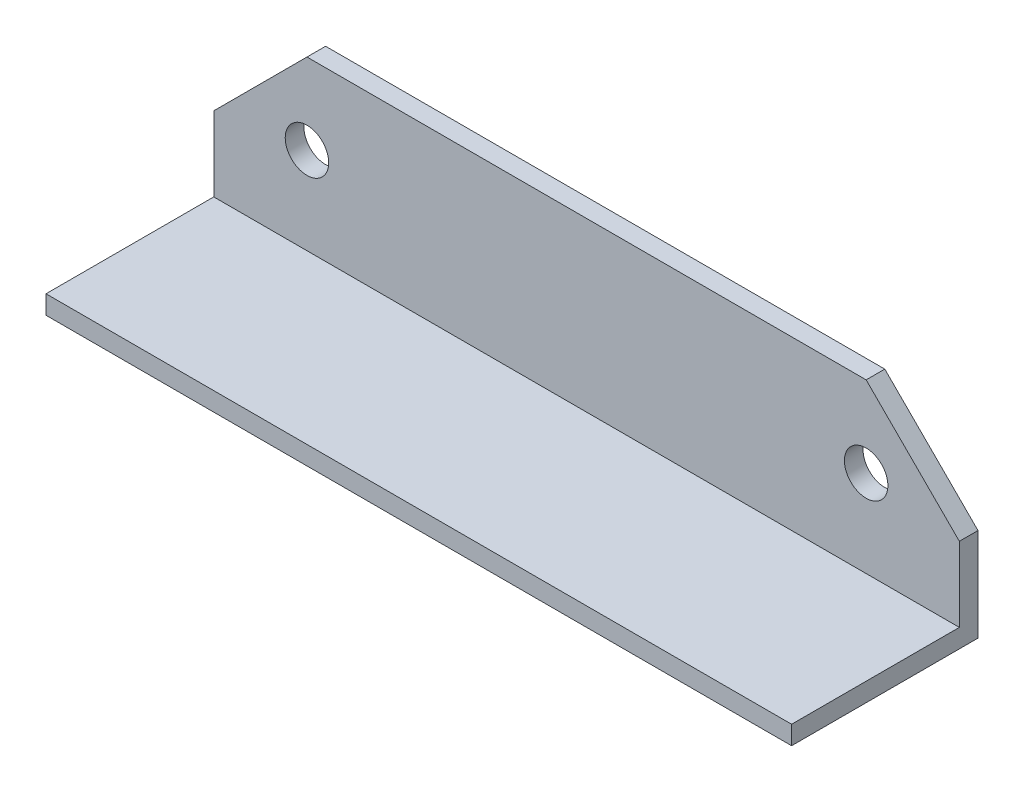
ISO-10303-21;
HEADER;
FILE_DESCRIPTION(('STEP AP214'),'2;1');
FILE_NAME('part.step','',(''),(''),'','','');
FILE_SCHEMA(('AUTOMOTIVE_DESIGN { 1 0 10303 214 1 1 1 1 }'));
ENDSEC;
DATA;
#1=APPLICATION_CONTEXT('core data for automotive mechanical design processes');
#2=APPLICATION_PROTOCOL_DEFINITION('international standard','automotive_design',2000,#1);
#3=PRODUCT_CONTEXT('',#1,'mechanical');
#4=PRODUCT('Part','Part','',(#3));
#5=PRODUCT_RELATED_PRODUCT_CATEGORY('part','',(#4));
#6=PRODUCT_DEFINITION_FORMATION('','',#4);
#7=PRODUCT_DEFINITION_CONTEXT('part definition',#1,'design');
#8=PRODUCT_DEFINITION('design','',#6,#7);
#9=PRODUCT_DEFINITION_SHAPE('','',#8);
#10=(LENGTH_UNIT() NAMED_UNIT(*) SI_UNIT(.MILLI.,.METRE.));
#11=(NAMED_UNIT(*) PLANE_ANGLE_UNIT() SI_UNIT($,.RADIAN.));
#12=(NAMED_UNIT(*) SI_UNIT($,.STERADIAN.) SOLID_ANGLE_UNIT());
#13=UNCERTAINTY_MEASURE_WITH_UNIT(LENGTH_MEASURE(1.E-05),#10,'distance_accuracy_value','');
#14=(GEOMETRIC_REPRESENTATION_CONTEXT(3) GLOBAL_UNCERTAINTY_ASSIGNED_CONTEXT((#13)) GLOBAL_UNIT_ASSIGNED_CONTEXT((#10,
#11,#12)) REPRESENTATION_CONTEXT('',''));
#15=CARTESIAN_POINT('',(0.,0.,0.));
#16=DIRECTION('',(0.,0.,1.));
#17=DIRECTION('',(1.,0.,0.));
#18=AXIS2_PLACEMENT_3D('',#15,#16,#17);
#19=CARTESIAN_POINT('',(0.,0.,-77.1201360343224));
#20=DIRECTION('',(0.,0.,-1.));
#21=DIRECTION('',(-1.,0.,0.));
#22=AXIS2_PLACEMENT_3D('',#19,#20,#21);
#23=PLANE('',#22);
#24=CARTESIAN_POINT('',(-44.999999999999,664.649987792969,-77.1201360343224));
#25=DIRECTION('',(0.,0.,-1.));
#26=DIRECTION('',(-1.,0.,0.));
#27=AXIS2_PLACEMENT_3D('',#24,#25,#26);
#28=CIRCLE('',#27,3.49999999999999);
#29=CARTESIAN_POINT('',(-48.499999999999,664.649987792969,-77.1201360343224));
#30=VERTEX_POINT('',#29);
#31=EDGE_CURVE('E189',#30,#30,#28,.T.);
#32=ORIENTED_EDGE('',*,*,#31,.T.);
#33=EDGE_LOOP('',(#32));
#34=FACE_BOUND('',#33,.T.);
#35=CARTESIAN_POINT('',(45.0000000000004,664.649987792969,-77.1201360343224));
#36=DIRECTION('',(0.,0.,-1.));
#37=DIRECTION('',(-1.,0.,0.));
#38=AXIS2_PLACEMENT_3D('',#35,#36,#37);
#39=CIRCLE('',#38,3.49999999999999);
#40=CARTESIAN_POINT('',(41.5000000000004,664.649987792969,-77.1201360343224));
#41=VERTEX_POINT('',#40);
#42=EDGE_CURVE('E37',#41,#41,#39,.T.);
#43=ORIENTED_EDGE('',*,*,#42,.T.);
#44=EDGE_LOOP('',(#43));
#45=FACE_BOUND('',#44,.T.);
#46=DIRECTION('',(-1.,0.,0.));
#47=VECTOR('',#46,1.);
#48=CARTESIAN_POINT('',(-59.999999999999,650.649987792969,-77.1201360343224));
#49=LINE('',#48,#47);
#50=CARTESIAN_POINT('',(60.0000000000004,650.649987792969,-77.1201360343224));
#51=VERTEX_POINT('',#50);
#52=CARTESIAN_POINT('',(-59.999999999999,650.649987792969,-77.1201360343224));
#53=VERTEX_POINT('',#52);
#54=EDGE_CURVE('E50',#51,#53,#49,.T.);
#55=ORIENTED_EDGE('',*,*,#54,.F.);
#56=DIRECTION('',(0.,1.,0.));
#57=VECTOR('',#56,1.);
#58=CARTESIAN_POINT('',(60.0000000000004,647.649987792969,-77.1201360343224));
#59=LINE('',#58,#57);
#60=CARTESIAN_POINT('',(60.0000000000004,662.649987792969,-77.1201360343224));
#61=VERTEX_POINT('',#60);
#62=EDGE_CURVE('E133',#51,#61,#59,.T.);
#63=ORIENTED_EDGE('',*,*,#62,.T.);
#64=DIRECTION('',(-0.707106781186545,0.70710678118655,0.));
#65=VECTOR('',#64,1.);
#66=CARTESIAN_POINT('',(60.0000000000004,662.649987792969,-77.1201360343224));
#67=LINE('',#66,#65);
#68=CARTESIAN_POINT('',(45.0000000000004,677.649987792969,-77.1201360343224));
#69=VERTEX_POINT('',#68);
#70=EDGE_CURVE('E104',#61,#69,#67,.T.);
#71=ORIENTED_EDGE('',*,*,#70,.T.);
#72=DIRECTION('',(-1.,0.,0.));
#73=VECTOR('',#72,1.);
#74=CARTESIAN_POINT('',(45.0000000000004,677.649987792969,-77.1201360343224));
#75=LINE('',#74,#73);
#76=CARTESIAN_POINT('',(-44.999999999999,677.649987792969,-77.1201360343224));
#77=VERTEX_POINT('',#76);
#78=EDGE_CURVE('E136',#69,#77,#75,.T.);
#79=ORIENTED_EDGE('',*,*,#78,.T.);
#80=DIRECTION('',(-0.707106781186548,-0.707106781186548,0.));
#81=VECTOR('',#80,1.);
#82=CARTESIAN_POINT('',(-44.999999999999,677.649987792969,-77.1201360343224));
#83=LINE('',#82,#81);
#84=CARTESIAN_POINT('',(-59.999999999999,662.649987792969,-77.1201360343224));
#85=VERTEX_POINT('',#84);
#86=EDGE_CURVE('E127',#77,#85,#83,.T.);
#87=ORIENTED_EDGE('',*,*,#86,.T.);
#88=DIRECTION('',(0.,-1.,0.));
#89=VECTOR('',#88,1.);
#90=CARTESIAN_POINT('',(-59.999999999999,662.649987792969,-77.1201360343224));
#91=LINE('',#90,#89);
#92=EDGE_CURVE('E130',#85,#53,#91,.T.);
#93=ORIENTED_EDGE('',*,*,#92,.T.);
#94=EDGE_LOOP('',(#55,#63,#71,#79,#87,#93));
#95=FACE_BOUND('',#94,.T.);
#96=ADVANCED_FACE('F33',(#34,#45,#95),#23,.F.);
#97=CARTESIAN_POINT('',(-44.999999999999,677.649987792969,-80.1201360343224));
#98=DIRECTION('',(-0.707106781186547,0.707106781186547,0.));
#99=DIRECTION('',(-0.707106781186548,-0.707106781186548,0.));
#100=AXIS2_PLACEMENT_3D('',#97,#98,#99);
#101=PLANE('',#100);
#102=ORIENTED_EDGE('',*,*,#86,.F.);
#103=DIRECTION('',(0.,0.,1.));
#104=VECTOR('',#103,1.);
#105=CARTESIAN_POINT('',(-44.999999999999,677.649987792969,-80.1201360343224));
#106=LINE('',#105,#104);
#107=CARTESIAN_POINT('',(-44.999999999999,677.649987792969,-80.1201360343224));
#108=VERTEX_POINT('',#107);
#109=EDGE_CURVE('E11',#108,#77,#106,.T.);
#110=ORIENTED_EDGE('',*,*,#109,.F.);
#111=DIRECTION('',(-0.707106781186548,-0.707106781186548,0.));
#112=VECTOR('',#111,1.);
#113=CARTESIAN_POINT('',(-44.999999999999,677.649987792969,-80.1201360343224));
#114=LINE('',#113,#112);
#115=CARTESIAN_POINT('',(-59.999999999999,662.649987792969,-80.1201360343224));
#116=VERTEX_POINT('',#115);
#117=EDGE_CURVE('E138',#108,#116,#114,.T.);
#118=ORIENTED_EDGE('',*,*,#117,.T.);
#119=DIRECTION('',(0.,0.,1.));
#120=VECTOR('',#119,1.);
#121=CARTESIAN_POINT('',(-59.999999999999,662.649987792969,-80.1201360343224));
#122=LINE('',#121,#120);
#123=EDGE_CURVE('E83',#116,#85,#122,.T.);
#124=ORIENTED_EDGE('',*,*,#123,.T.);
#125=EDGE_LOOP('',(#102,#110,#118,#124));
#126=FACE_BOUND('',#125,.T.);
#127=ADVANCED_FACE('F35',(#126),#101,.T.);
#128=CARTESIAN_POINT('',(45.0000000000004,677.649987792969,-80.1201360343224));
#129=DIRECTION('',(0.,1.,0.));
#130=DIRECTION('',(-1.,0.,0.));
#131=AXIS2_PLACEMENT_3D('',#128,#129,#130);
#132=PLANE('',#131);
#133=ORIENTED_EDGE('',*,*,#78,.F.);
#134=DIRECTION('',(0.,0.,1.));
#135=VECTOR('',#134,1.);
#136=CARTESIAN_POINT('',(45.0000000000004,677.649987792969,-80.1201360343224));
#137=LINE('',#136,#135);
#138=CARTESIAN_POINT('',(45.0000000000004,677.649987792969,-80.1201360343224));
#139=VERTEX_POINT('',#138);
#140=EDGE_CURVE('E42',#139,#69,#137,.T.);
#141=ORIENTED_EDGE('',*,*,#140,.F.);
#142=DIRECTION('',(-1.,0.,0.));
#143=VECTOR('',#142,1.);
#144=CARTESIAN_POINT('',(45.0000000000004,677.649987792969,-80.1201360343224));
#145=LINE('',#144,#143);
#146=EDGE_CURVE('E115',#139,#108,#145,.T.);
#147=ORIENTED_EDGE('',*,*,#146,.T.);
#148=ORIENTED_EDGE('',*,*,#109,.T.);
#149=EDGE_LOOP('',(#133,#141,#147,#148));
#150=FACE_BOUND('',#149,.T.);
#151=ADVANCED_FACE('F148',(#150),#132,.T.);
#152=CARTESIAN_POINT('',(60.0000000000004,662.649987792969,-80.1201360343224));
#153=DIRECTION('',(0.70710678118655,0.707106781186545,0.));
#154=DIRECTION('',(-0.707106781186545,0.70710678118655,0.));
#155=AXIS2_PLACEMENT_3D('',#152,#153,#154);
#156=PLANE('',#155);
#157=ORIENTED_EDGE('',*,*,#70,.F.);
#158=DIRECTION('',(0.,0.,1.));
#159=VECTOR('',#158,1.);
#160=CARTESIAN_POINT('',(60.0000000000004,662.649987792969,-80.1201360343224));
#161=LINE('',#160,#159);
#162=CARTESIAN_POINT('',(60.0000000000004,662.649987792969,-80.1201360343224));
#163=VERTEX_POINT('',#162);
#164=EDGE_CURVE('E98',#163,#61,#161,.T.);
#165=ORIENTED_EDGE('',*,*,#164,.F.);
#166=DIRECTION('',(-0.707106781186545,0.70710678118655,0.));
#167=VECTOR('',#166,1.);
#168=CARTESIAN_POINT('',(60.0000000000004,662.649987792969,-80.1201360343224));
#169=LINE('',#168,#167);
#170=EDGE_CURVE('E101',#163,#139,#169,.T.);
#171=ORIENTED_EDGE('',*,*,#170,.T.);
#172=ORIENTED_EDGE('',*,*,#140,.T.);
#173=EDGE_LOOP('',(#157,#165,#171,#172));
#174=FACE_BOUND('',#173,.T.);
#175=ADVANCED_FACE('F100',(#174),#156,.T.);
#176=CARTESIAN_POINT('',(60.0000000000004,647.649987792969,-80.1201360343224));
#177=DIRECTION('',(1.,0.,0.));
#178=DIRECTION('',(0.,1.,0.));
#179=AXIS2_PLACEMENT_3D('',#176,#177,#178);
#180=PLANE('',#179);
#181=ORIENTED_EDGE('',*,*,#62,.F.);
#182=DIRECTION('',(0.,0.,-1.));
#183=VECTOR('',#182,1.);
#184=CARTESIAN_POINT('',(60.0000000000004,650.649987792969,-50.1201360343224));
#185=LINE('',#184,#183);
#186=CARTESIAN_POINT('',(60.0000000000004,650.649987792969,-50.1201360343224));
#187=VERTEX_POINT('',#186);
#188=EDGE_CURVE('E208',#187,#51,#185,.T.);
#189=ORIENTED_EDGE('',*,*,#188,.F.);
#190=DIRECTION('',(0.,1.,0.));
#191=VECTOR('',#190,1.);
#192=CARTESIAN_POINT('',(60.0000000000004,650.649987792969,-50.1201360343224));
#193=LINE('',#192,#191);
#194=CARTESIAN_POINT('',(60.0000000000004,647.649987792969,-50.1201360343224));
#195=VERTEX_POINT('',#194);
#196=EDGE_CURVE('E205',#195,#187,#193,.T.);
#197=ORIENTED_EDGE('',*,*,#196,.F.);
#198=DIRECTION('',(0.,0.,1.));
#199=VECTOR('',#198,1.);
#200=CARTESIAN_POINT('',(60.0000000000004,647.649987792969,-80.1201360343224));
#201=LINE('',#200,#199);
#202=CARTESIAN_POINT('',(60.0000000000004,647.649987792969,-80.1201360343224));
#203=VERTEX_POINT('',#202);
#204=EDGE_CURVE('E107',#203,#195,#201,.T.);
#205=ORIENTED_EDGE('',*,*,#204,.F.);
#206=DIRECTION('',(0.,1.,0.));
#207=VECTOR('',#206,1.);
#208=CARTESIAN_POINT('',(60.0000000000004,647.649987792969,-80.1201360343224));
#209=LINE('',#208,#207);
#210=EDGE_CURVE('E113',#203,#163,#209,.T.);
#211=ORIENTED_EDGE('',*,*,#210,.T.);
#212=ORIENTED_EDGE('',*,*,#164,.T.);
#213=EDGE_LOOP('',(#181,#189,#197,#205,#211,#212));
#214=FACE_BOUND('',#213,.T.);
#215=ADVANCED_FACE('F117',(#214),#180,.T.);
#216=CARTESIAN_POINT('',(-59.999999999999,647.649987792969,-80.1201360343224));
#217=DIRECTION('',(0.,-1.,0.));
#218=DIRECTION('',(1.,0.,0.));
#219=AXIS2_PLACEMENT_3D('',#216,#217,#218);
#220=PLANE('',#219);
#221=ORIENTED_EDGE('',*,*,#204,.T.);
#222=DIRECTION('',(1.,0.,0.));
#223=VECTOR('',#222,1.);
#224=CARTESIAN_POINT('',(60.0000000000004,647.649987792969,-50.1201360343224));
#225=LINE('',#224,#223);
#226=CARTESIAN_POINT('',(-59.999999999999,647.649987792969,-50.1201360343224));
#227=VERTEX_POINT('',#226);
#228=EDGE_CURVE('E202',#227,#195,#225,.T.);
#229=ORIENTED_EDGE('',*,*,#228,.F.);
#230=DIRECTION('',(0.,0.,1.));
#231=VECTOR('',#230,1.);
#232=CARTESIAN_POINT('',(-59.999999999999,647.649987792969,-80.1201360343224));
#233=LINE('',#232,#231);
#234=CARTESIAN_POINT('',(-59.999999999999,647.649987792969,-80.1201360343224));
#235=VERTEX_POINT('',#234);
#236=EDGE_CURVE('E142',#235,#227,#233,.T.);
#237=ORIENTED_EDGE('',*,*,#236,.F.);
#238=DIRECTION('',(1.,0.,0.));
#239=VECTOR('',#238,1.);
#240=CARTESIAN_POINT('',(-59.999999999999,647.649987792969,-80.1201360343224));
#241=LINE('',#240,#239);
#242=EDGE_CURVE('E120',#235,#203,#241,.T.);
#243=ORIENTED_EDGE('',*,*,#242,.T.);
#244=EDGE_LOOP('',(#221,#229,#237,#243));
#245=FACE_BOUND('',#244,.T.);
#246=ADVANCED_FACE('F215',(#245),#220,.T.);
#247=CARTESIAN_POINT('',(-59.999999999999,662.649987792969,-80.1201360343224));
#248=DIRECTION('',(-1.,0.,0.));
#249=DIRECTION('',(0.,-1.,0.));
#250=AXIS2_PLACEMENT_3D('',#247,#248,#249);
#251=PLANE('',#250);
#252=ORIENTED_EDGE('',*,*,#92,.F.);
#253=ORIENTED_EDGE('',*,*,#123,.F.);
#254=DIRECTION('',(0.,-1.,0.));
#255=VECTOR('',#254,1.);
#256=CARTESIAN_POINT('',(-59.999999999999,662.649987792969,-80.1201360343224));
#257=LINE('',#256,#255);
#258=EDGE_CURVE('E122',#116,#235,#257,.T.);
#259=ORIENTED_EDGE('',*,*,#258,.T.);
#260=ORIENTED_EDGE('',*,*,#236,.T.);
#261=DIRECTION('',(0.,-1.,0.));
#262=VECTOR('',#261,1.);
#263=CARTESIAN_POINT('',(-59.999999999999,647.649987792969,-50.1201360343224));
#264=LINE('',#263,#262);
#265=CARTESIAN_POINT('',(-59.999999999999,650.649987792969,-50.1201360343224));
#266=VERTEX_POINT('',#265);
#267=EDGE_CURVE('E199',#266,#227,#264,.T.);
#268=ORIENTED_EDGE('',*,*,#267,.F.);
#269=DIRECTION('',(0.,0.,-1.));
#270=VECTOR('',#269,1.);
#271=CARTESIAN_POINT('',(-59.999999999999,650.649987792969,-50.1201360343224));
#272=LINE('',#271,#270);
#273=EDGE_CURVE('E131',#266,#53,#272,.T.);
#274=ORIENTED_EDGE('',*,*,#273,.T.);
#275=EDGE_LOOP('',(#252,#253,#259,#260,#268,#274));
#276=FACE_BOUND('',#275,.T.);
#277=ADVANCED_FACE('F145',(#276),#251,.T.);
#278=CARTESIAN_POINT('',(0.,0.,-80.1201360343224));
#279=DIRECTION('',(0.,0.,-1.));
#280=DIRECTION('',(-1.,0.,0.));
#281=AXIS2_PLACEMENT_3D('',#278,#279,#280);
#282=PLANE('',#281);
#283=CARTESIAN_POINT('',(-44.999999999999,664.649987792969,-80.1201360343224));
#284=DIRECTION('',(0.,0.,-1.));
#285=DIRECTION('',(-1.,0.,0.));
#286=AXIS2_PLACEMENT_3D('',#283,#284,#285);
#287=CIRCLE('',#286,3.49999999999999);
#288=CARTESIAN_POINT('',(-48.499999999999,664.649987792969,-80.1201360343224));
#289=VERTEX_POINT('',#288);
#290=EDGE_CURVE('E187',#289,#289,#287,.T.);
#291=ORIENTED_EDGE('',*,*,#290,.F.);
#292=EDGE_LOOP('',(#291));
#293=FACE_BOUND('',#292,.T.);
#294=CARTESIAN_POINT('',(45.0000000000004,664.649987792969,-80.1201360343224));
#295=DIRECTION('',(0.,0.,-1.));
#296=DIRECTION('',(-1.,0.,0.));
#297=AXIS2_PLACEMENT_3D('',#294,#295,#296);
#298=CIRCLE('',#297,3.49999999999999);
#299=CARTESIAN_POINT('',(41.5000000000004,664.649987792969,-80.1201360343224));
#300=VERTEX_POINT('',#299);
#301=EDGE_CURVE('E190',#300,#300,#298,.T.);
#302=ORIENTED_EDGE('',*,*,#301,.F.);
#303=EDGE_LOOP('',(#302));
#304=FACE_BOUND('',#303,.T.);
#305=ORIENTED_EDGE('',*,*,#117,.F.);
#306=ORIENTED_EDGE('',*,*,#146,.F.);
#307=ORIENTED_EDGE('',*,*,#170,.F.);
#308=ORIENTED_EDGE('',*,*,#210,.F.);
#309=ORIENTED_EDGE('',*,*,#242,.F.);
#310=ORIENTED_EDGE('',*,*,#258,.F.);
#311=EDGE_LOOP('',(#305,#306,#307,#308,#309,#310));
#312=FACE_BOUND('',#311,.T.);
#313=ADVANCED_FACE('F111',(#293,#304,#312),#282,.T.);
#314=CARTESIAN_POINT('',(-59.999999999999,650.649987792969,-50.1201360343224));
#315=DIRECTION('',(0.,-1.,0.));
#316=DIRECTION('',(0.,0.,-1.));
#317=AXIS2_PLACEMENT_3D('',#314,#315,#316);
#318=PLANE('',#317);
#319=ORIENTED_EDGE('',*,*,#54,.T.);
#320=ORIENTED_EDGE('',*,*,#273,.F.);
#321=DIRECTION('',(-1.,0.,0.));
#322=VECTOR('',#321,1.);
#323=CARTESIAN_POINT('',(-59.999999999999,650.649987792969,-50.1201360343224));
#324=LINE('',#323,#322);
#325=EDGE_CURVE('E196',#187,#266,#324,.T.);
#326=ORIENTED_EDGE('',*,*,#325,.F.);
#327=ORIENTED_EDGE('',*,*,#188,.T.);
#328=EDGE_LOOP('',(#319,#320,#326,#327));
#329=FACE_BOUND('',#328,.T.);
#330=ADVANCED_FACE('F166',(#329),#318,.F.);
#331=CARTESIAN_POINT('',(0.,0.,-50.1201360343224));
#332=DIRECTION('',(0.,0.,-1.));
#333=DIRECTION('',(-1.,0.,0.));
#334=AXIS2_PLACEMENT_3D('',#331,#332,#333);
#335=PLANE('',#334);
#336=ORIENTED_EDGE('',*,*,#325,.T.);
#337=ORIENTED_EDGE('',*,*,#267,.T.);
#338=ORIENTED_EDGE('',*,*,#228,.T.);
#339=ORIENTED_EDGE('',*,*,#196,.T.);
#340=EDGE_LOOP('',(#336,#337,#338,#339));
#341=FACE_BOUND('',#340,.T.);
#342=ADVANCED_FACE('F170',(#341),#335,.F.);
#343=CARTESIAN_POINT('',(45.0000000000004,664.649987792969,-80.1201360343224));
#344=DIRECTION('',(0.,0.,-1.));
#345=DIRECTION('',(-1.,0.,0.));
#346=AXIS2_PLACEMENT_3D('',#343,#344,#345);
#347=CYLINDRICAL_SURFACE('',#346,3.49999999999999);
#348=ORIENTED_EDGE('',*,*,#301,.T.);
#349=EDGE_LOOP('',(#348));
#350=FACE_BOUND('',#349,.T.);
#351=ORIENTED_EDGE('',*,*,#42,.F.);
#352=EDGE_LOOP('',(#351));
#353=FACE_BOUND('',#352,.T.);
#354=ADVANCED_FACE('F174',(#350,#353),#347,.F.);
#355=CARTESIAN_POINT('',(-44.999999999999,664.649987792969,-80.1201360343224));
#356=DIRECTION('',(0.,0.,-1.));
#357=DIRECTION('',(-1.,0.,0.));
#358=AXIS2_PLACEMENT_3D('',#355,#356,#357);
#359=CYLINDRICAL_SURFACE('',#358,3.49999999999999);
#360=ORIENTED_EDGE('',*,*,#290,.T.);
#361=EDGE_LOOP('',(#360));
#362=FACE_BOUND('',#361,.T.);
#363=ORIENTED_EDGE('',*,*,#31,.F.);
#364=EDGE_LOOP('',(#363));
#365=FACE_BOUND('',#364,.T.);
#366=ADVANCED_FACE('F178',(#362,#365),#359,.F.);
#367=CLOSED_SHELL('',(#96,#127,#151,#175,#215,#246,#277,#313,#330,#342,#354,#366));
#368=MANIFOLD_SOLID_BREP('B2',#367);
#369=ADVANCED_BREP_SHAPE_REPRESENTATION('',(#18,#368),#14);
#370=SHAPE_DEFINITION_REPRESENTATION(#9,#369);
ENDSEC;
END-ISO-10303-21;
